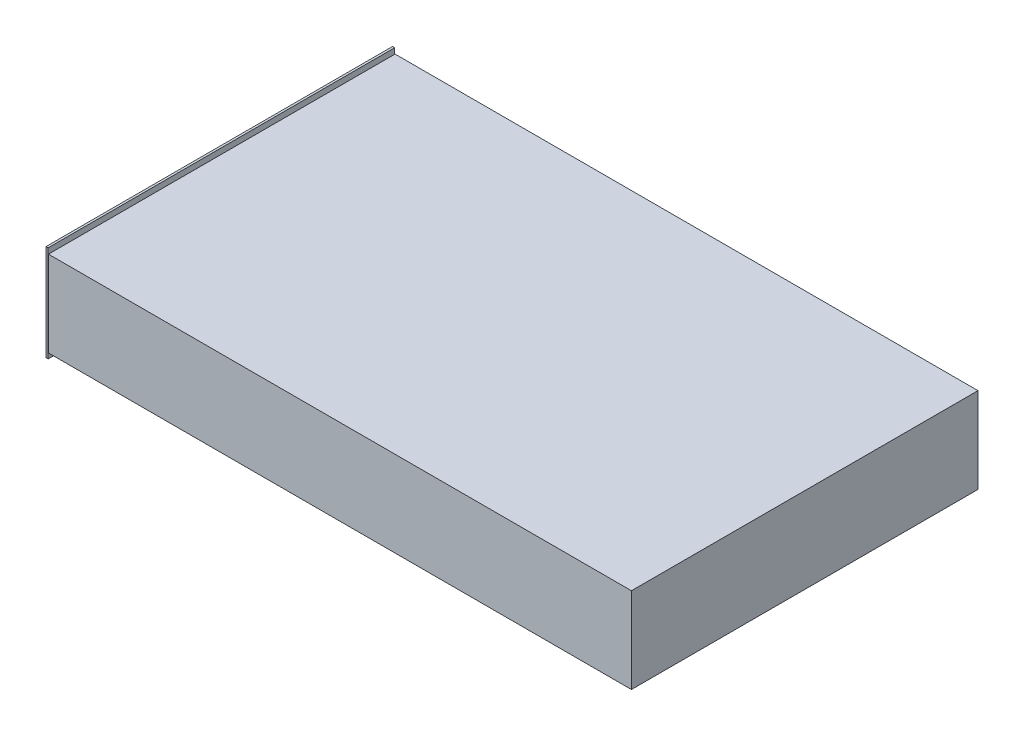
ISO-10303-21;
HEADER;
FILE_DESCRIPTION(('STEP AP214'),'2;1');
FILE_NAME('part.step','',(''),(''),'','','');
FILE_SCHEMA(('AUTOMOTIVE_DESIGN { 1 0 10303 214 1 1 1 1 }'));
ENDSEC;
DATA;
#1=APPLICATION_CONTEXT('core data for automotive mechanical design processes');
#2=APPLICATION_PROTOCOL_DEFINITION('international standard','automotive_design',2000,#1);
#3=PRODUCT_CONTEXT('',#1,'mechanical');
#4=PRODUCT('Part','Part','',(#3));
#5=PRODUCT_RELATED_PRODUCT_CATEGORY('part','',(#4));
#6=PRODUCT_DEFINITION_FORMATION('','',#4);
#7=PRODUCT_DEFINITION_CONTEXT('part definition',#1,'design');
#8=PRODUCT_DEFINITION('design','',#6,#7);
#9=PRODUCT_DEFINITION_SHAPE('','',#8);
#10=(LENGTH_UNIT() NAMED_UNIT(*) SI_UNIT(.MILLI.,.METRE.));
#11=(NAMED_UNIT(*) PLANE_ANGLE_UNIT() SI_UNIT($,.RADIAN.));
#12=(NAMED_UNIT(*) SI_UNIT($,.STERADIAN.) SOLID_ANGLE_UNIT());
#13=UNCERTAINTY_MEASURE_WITH_UNIT(LENGTH_MEASURE(1.E-05),#10,'distance_accuracy_value','');
#14=(GEOMETRIC_REPRESENTATION_CONTEXT(3) GLOBAL_UNCERTAINTY_ASSIGNED_CONTEXT((#13)) GLOBAL_UNIT_ASSIGNED_CONTEXT((#10,
#11,#12)) REPRESENTATION_CONTEXT('',''));
#15=CARTESIAN_POINT('',(0.,0.,0.));
#16=DIRECTION('',(0.,0.,1.));
#17=DIRECTION('',(1.,0.,0.));
#18=AXIS2_PLACEMENT_3D('',#15,#16,#17);
#19=CARTESIAN_POINT('',(0.,-5.,162.));
#20=DIRECTION('',(-1.,0.,0.));
#21=DIRECTION('',(0.,0.,1.));
#22=AXIS2_PLACEMENT_3D('',#19,#20,#21);
#23=PLANE('',#22);
#24=DIRECTION('',(0.,1.,0.));
#25=VECTOR('',#24,1.);
#26=CARTESIAN_POINT('',(0.,-5.,-162.));
#27=LINE('',#26,#25);
#28=CARTESIAN_POINT('',(0.,-5.,-162.));
#29=VERTEX_POINT('',#28);
#30=CARTESIAN_POINT('',(0.,85.,-162.));
#31=VERTEX_POINT('',#30);
#32=EDGE_CURVE('E107',#29,#31,#27,.T.);
#33=ORIENTED_EDGE('',*,*,#32,.T.);
#34=DIRECTION('',(0.,0.,-1.));
#35=VECTOR('',#34,1.);
#36=CARTESIAN_POINT('',(0.,85.,162.));
#37=LINE('',#36,#35);
#38=CARTESIAN_POINT('',(0.,85.,162.));
#39=VERTEX_POINT('',#38);
#40=EDGE_CURVE('E12',#39,#31,#37,.T.);
#41=ORIENTED_EDGE('',*,*,#40,.F.);
#42=DIRECTION('',(0.,1.,0.));
#43=VECTOR('',#42,1.);
#44=CARTESIAN_POINT('',(0.,-5.,162.));
#45=LINE('',#44,#43);
#46=CARTESIAN_POINT('',(0.,-5.,162.));
#47=VERTEX_POINT('',#46);
#48=EDGE_CURVE('E84',#47,#39,#45,.T.);
#49=ORIENTED_EDGE('',*,*,#48,.F.);
#50=DIRECTION('',(0.,0.,-1.));
#51=VECTOR('',#50,1.);
#52=CARTESIAN_POINT('',(0.,-5.,162.));
#53=LINE('',#52,#51);
#54=EDGE_CURVE('E60',#47,#29,#53,.T.);
#55=ORIENTED_EDGE('',*,*,#54,.T.);
#56=EDGE_LOOP('',(#33,#41,#49,#55));
#57=FACE_BOUND('',#56,.T.);
#58=ADVANCED_FACE('F44',(#57),#23,.F.);
#59=CARTESIAN_POINT('',(-2.,85.,162.));
#60=DIRECTION('',(0.,1.,0.));
#61=DIRECTION('',(0.,0.,1.));
#62=AXIS2_PLACEMENT_3D('',#59,#60,#61);
#63=PLANE('',#62);
#64=DIRECTION('',(1.,0.,0.));
#65=VECTOR('',#64,1.);
#66=CARTESIAN_POINT('',(-2.,85.,-162.));
#67=LINE('',#66,#65);
#68=CARTESIAN_POINT('',(-2.,85.,-162.));
#69=VERTEX_POINT('',#68);
#70=EDGE_CURVE('E93',#69,#31,#67,.T.);
#71=ORIENTED_EDGE('',*,*,#70,.F.);
#72=DIRECTION('',(0.,0.,-1.));
#73=VECTOR('',#72,1.);
#74=CARTESIAN_POINT('',(-2.,85.,162.));
#75=LINE('',#74,#73);
#76=CARTESIAN_POINT('',(-2.,85.,162.));
#77=VERTEX_POINT('',#76);
#78=EDGE_CURVE('E52',#77,#69,#75,.T.);
#79=ORIENTED_EDGE('',*,*,#78,.F.);
#80=DIRECTION('',(1.,0.,0.));
#81=VECTOR('',#80,1.);
#82=CARTESIAN_POINT('',(-2.,85.,162.));
#83=LINE('',#82,#81);
#84=EDGE_CURVE('E91',#77,#39,#83,.T.);
#85=ORIENTED_EDGE('',*,*,#84,.T.);
#86=ORIENTED_EDGE('',*,*,#40,.T.);
#87=EDGE_LOOP('',(#71,#79,#85,#86));
#88=FACE_BOUND('',#87,.T.);
#89=ADVANCED_FACE('F90',(#88),#63,.T.);
#90=CARTESIAN_POINT('',(-2.,-5.,162.));
#91=DIRECTION('',(-1.,0.,0.));
#92=DIRECTION('',(0.,0.,1.));
#93=AXIS2_PLACEMENT_3D('',#90,#91,#92);
#94=PLANE('',#93);
#95=DIRECTION('',(0.,1.,0.));
#96=VECTOR('',#95,1.);
#97=CARTESIAN_POINT('',(-2.,-5.,-162.));
#98=LINE('',#97,#96);
#99=CARTESIAN_POINT('',(-2.,-5.,-162.));
#100=VERTEX_POINT('',#99);
#101=EDGE_CURVE('E110',#100,#69,#98,.T.);
#102=ORIENTED_EDGE('',*,*,#101,.F.);
#103=DIRECTION('',(0.,0.,-1.));
#104=VECTOR('',#103,1.);
#105=CARTESIAN_POINT('',(-2.,-5.,162.));
#106=LINE('',#105,#104);
#107=CARTESIAN_POINT('',(-2.,-5.,162.));
#108=VERTEX_POINT('',#107);
#109=EDGE_CURVE('E73',#108,#100,#106,.T.);
#110=ORIENTED_EDGE('',*,*,#109,.F.);
#111=DIRECTION('',(0.,1.,0.));
#112=VECTOR('',#111,1.);
#113=CARTESIAN_POINT('',(-2.,-5.,162.));
#114=LINE('',#113,#112);
#115=EDGE_CURVE('E99',#108,#77,#114,.T.);
#116=ORIENTED_EDGE('',*,*,#115,.T.);
#117=ORIENTED_EDGE('',*,*,#78,.T.);
#118=EDGE_LOOP('',(#102,#110,#116,#117));
#119=FACE_BOUND('',#118,.T.);
#120=ADVANCED_FACE('F101',(#119),#94,.T.);
#121=CARTESIAN_POINT('',(0.,-5.,162.));
#122=DIRECTION('',(0.,-1.,0.));
#123=DIRECTION('',(0.,0.,-1.));
#124=AXIS2_PLACEMENT_3D('',#121,#122,#123);
#125=PLANE('',#124);
#126=DIRECTION('',(-1.,0.,0.));
#127=VECTOR('',#126,1.);
#128=CARTESIAN_POINT('',(0.,-5.,-162.));
#129=LINE('',#128,#127);
#130=EDGE_CURVE('E112',#29,#100,#129,.T.);
#131=ORIENTED_EDGE('',*,*,#130,.F.);
#132=ORIENTED_EDGE('',*,*,#54,.F.);
#133=DIRECTION('',(-1.,0.,0.));
#134=VECTOR('',#133,1.);
#135=CARTESIAN_POINT('',(0.,-5.,162.));
#136=LINE('',#135,#134);
#137=EDGE_CURVE('E102',#47,#108,#136,.T.);
#138=ORIENTED_EDGE('',*,*,#137,.T.);
#139=ORIENTED_EDGE('',*,*,#109,.T.);
#140=EDGE_LOOP('',(#131,#132,#138,#139));
#141=FACE_BOUND('',#140,.T.);
#142=ADVANCED_FACE('F118',(#141),#125,.T.);
#143=CARTESIAN_POINT('',(0.,0.,162.));
#144=DIRECTION('',(0.,0.,-1.));
#145=DIRECTION('',(-1.,0.,0.));
#146=AXIS2_PLACEMENT_3D('',#143,#144,#145);
#147=PLANE('',#146);
#148=ORIENTED_EDGE('',*,*,#48,.T.);
#149=ORIENTED_EDGE('',*,*,#84,.F.);
#150=ORIENTED_EDGE('',*,*,#115,.F.);
#151=ORIENTED_EDGE('',*,*,#137,.F.);
#152=EDGE_LOOP('',(#148,#149,#150,#151));
#153=FACE_BOUND('',#152,.T.);
#154=ADVANCED_FACE('F98',(#153),#147,.F.);
#155=CARTESIAN_POINT('',(0.,0.,-162.));
#156=DIRECTION('',(0.,0.,-1.));
#157=DIRECTION('',(-1.,0.,0.));
#158=AXIS2_PLACEMENT_3D('',#155,#156,#157);
#159=PLANE('',#158);
#160=ORIENTED_EDGE('',*,*,#32,.F.);
#161=ORIENTED_EDGE('',*,*,#130,.T.);
#162=ORIENTED_EDGE('',*,*,#101,.T.);
#163=ORIENTED_EDGE('',*,*,#70,.T.);
#164=EDGE_LOOP('',(#160,#161,#162,#163));
#165=FACE_BOUND('',#164,.T.);
#166=ADVANCED_FACE('F117',(#165),#159,.T.);
#167=CLOSED_SHELL('',(#58,#89,#120,#142,#154,#166));
#168=MANIFOLD_SOLID_BREP('B2',#167);
#169=CARTESIAN_POINT('',(0.310787999523887,80.,162.));
#170=DIRECTION('',(1.,0.,0.));
#171=DIRECTION('',(0.,0.,-1.));
#172=AXIS2_PLACEMENT_3D('',#169,#170,#171);
#173=PLANE('',#172);
#174=DIRECTION('',(0.,0.,1.));
#175=VECTOR('',#174,1.);
#176=CARTESIAN_POINT('',(0.310787999523887,0.,162.));
#177=LINE('',#176,#175);
#178=CARTESIAN_POINT('',(0.310787999523887,0.,-162.));
#179=VERTEX_POINT('',#178);
#180=CARTESIAN_POINT('',(0.310787999523887,0.,162.));
#181=VERTEX_POINT('',#180);
#182=EDGE_CURVE('E266',#179,#181,#177,.T.);
#183=ORIENTED_EDGE('',*,*,#182,.T.);
#184=DIRECTION('',(0.,-1.,0.));
#185=VECTOR('',#184,1.);
#186=CARTESIAN_POINT('',(0.310787999523887,80.,162.));
#187=LINE('',#186,#185);
#188=CARTESIAN_POINT('',(0.310787999523887,80.,162.));
#189=VERTEX_POINT('',#188);
#190=EDGE_CURVE('E42',#189,#181,#187,.T.);
#191=ORIENTED_EDGE('',*,*,#190,.F.);
#192=DIRECTION('',(0.,0.,1.));
#193=VECTOR('',#192,1.);
#194=CARTESIAN_POINT('',(0.310787999523887,80.,162.));
#195=LINE('',#194,#193);
#196=CARTESIAN_POINT('',(0.310787999523887,80.,-162.));
#197=VERTEX_POINT('',#196);
#198=EDGE_CURVE('E276',#197,#189,#195,.T.);
#199=ORIENTED_EDGE('',*,*,#198,.F.);
#200=DIRECTION('',(0.,-1.,0.));
#201=VECTOR('',#200,1.);
#202=CARTESIAN_POINT('',(0.310787999523887,80.,-162.));
#203=LINE('',#202,#201);
#204=EDGE_CURVE('E281',#197,#179,#203,.T.);
#205=ORIENTED_EDGE('',*,*,#204,.T.);
#206=EDGE_LOOP('',(#183,#191,#199,#205));
#207=FACE_BOUND('',#206,.T.);
#208=ADVANCED_FACE('F168',(#207),#173,.F.);
#209=CARTESIAN_POINT('',(0.310787999523887,80.,162.));
#210=DIRECTION('',(0.,0.,-1.));
#211=DIRECTION('',(-1.,0.,0.));
#212=AXIS2_PLACEMENT_3D('',#209,#210,#211);
#213=PLANE('',#212);
#214=DIRECTION('',(1.,0.,0.));
#215=VECTOR('',#214,1.);
#216=CARTESIAN_POINT('',(0.310787999523887,0.,162.));
#217=LINE('',#216,#215);
#218=CARTESIAN_POINT('',(545.310787999524,0.,162.));
#219=VERTEX_POINT('',#218);
#220=EDGE_CURVE('E270',#181,#219,#217,.T.);
#221=ORIENTED_EDGE('',*,*,#220,.T.);
#222=DIRECTION('',(0.,-1.,0.));
#223=VECTOR('',#222,1.);
#224=CARTESIAN_POINT('',(545.310787999524,80.,162.));
#225=LINE('',#224,#223);
#226=CARTESIAN_POINT('',(545.310787999524,80.,162.));
#227=VERTEX_POINT('',#226);
#228=EDGE_CURVE('E176',#227,#219,#225,.T.);
#229=ORIENTED_EDGE('',*,*,#228,.F.);
#230=DIRECTION('',(1.,0.,0.));
#231=VECTOR('',#230,1.);
#232=CARTESIAN_POINT('',(0.310787999523887,80.,162.));
#233=LINE('',#232,#231);
#234=EDGE_CURVE('E215',#189,#227,#233,.T.);
#235=ORIENTED_EDGE('',*,*,#234,.F.);
#236=ORIENTED_EDGE('',*,*,#190,.T.);
#237=EDGE_LOOP('',(#221,#229,#235,#236));
#238=FACE_BOUND('',#237,.T.);
#239=ADVANCED_FACE('F305',(#238),#213,.F.);
#240=CARTESIAN_POINT('',(545.310787999524,80.,162.));
#241=DIRECTION('',(-1.,0.,0.));
#242=DIRECTION('',(0.,0.,1.));
#243=AXIS2_PLACEMENT_3D('',#240,#241,#242);
#244=PLANE('',#243);
#245=DIRECTION('',(0.,0.,-1.));
#246=VECTOR('',#245,1.);
#247=CARTESIAN_POINT('',(545.310787999524,0.,162.));
#248=LINE('',#247,#246);
#249=CARTESIAN_POINT('',(545.310787999524,0.,-162.));
#250=VERTEX_POINT('',#249);
#251=EDGE_CURVE('E202',#219,#250,#248,.T.);
#252=ORIENTED_EDGE('',*,*,#251,.T.);
#253=DIRECTION('',(0.,-1.,0.));
#254=VECTOR('',#253,1.);
#255=CARTESIAN_POINT('',(545.310787999524,80.,-162.));
#256=LINE('',#255,#254);
#257=CARTESIAN_POINT('',(545.310787999524,80.,-162.));
#258=VERTEX_POINT('',#257);
#259=EDGE_CURVE('E287',#258,#250,#256,.T.);
#260=ORIENTED_EDGE('',*,*,#259,.F.);
#261=DIRECTION('',(0.,0.,-1.));
#262=VECTOR('',#261,1.);
#263=CARTESIAN_POINT('',(545.310787999524,80.,162.));
#264=LINE('',#263,#262);
#265=EDGE_CURVE('E279',#227,#258,#264,.T.);
#266=ORIENTED_EDGE('',*,*,#265,.F.);
#267=ORIENTED_EDGE('',*,*,#228,.T.);
#268=EDGE_LOOP('',(#252,#260,#266,#267));
#269=FACE_BOUND('',#268,.T.);
#270=ADVANCED_FACE('F289',(#269),#244,.F.);
#271=CARTESIAN_POINT('',(0.310787999523887,80.,-162.));
#272=DIRECTION('',(0.,0.,1.));
#273=DIRECTION('',(1.,0.,0.));
#274=AXIS2_PLACEMENT_3D('',#271,#272,#273);
#275=PLANE('',#274);
#276=DIRECTION('',(-1.,0.,0.));
#277=VECTOR('',#276,1.);
#278=CARTESIAN_POINT('',(0.310787999523887,0.,-162.));
#279=LINE('',#278,#277);
#280=EDGE_CURVE('E208',#250,#179,#279,.T.);
#281=ORIENTED_EDGE('',*,*,#280,.T.);
#282=ORIENTED_EDGE('',*,*,#204,.F.);
#283=DIRECTION('',(-1.,0.,0.));
#284=VECTOR('',#283,1.);
#285=CARTESIAN_POINT('',(0.310787999523887,80.,-162.));
#286=LINE('',#285,#284);
#287=EDGE_CURVE('E184',#258,#197,#286,.T.);
#288=ORIENTED_EDGE('',*,*,#287,.F.);
#289=ORIENTED_EDGE('',*,*,#259,.T.);
#290=EDGE_LOOP('',(#281,#282,#288,#289));
#291=FACE_BOUND('',#290,.T.);
#292=ADVANCED_FACE('F296',(#291),#275,.F.);
#293=CARTESIAN_POINT('',(0.,80.,0.));
#294=DIRECTION('',(0.,1.,0.));
#295=DIRECTION('',(0.,0.,1.));
#296=AXIS2_PLACEMENT_3D('',#293,#294,#295);
#297=PLANE('',#296);
#298=ORIENTED_EDGE('',*,*,#198,.T.);
#299=ORIENTED_EDGE('',*,*,#234,.T.);
#300=ORIENTED_EDGE('',*,*,#265,.T.);
#301=ORIENTED_EDGE('',*,*,#287,.T.);
#302=EDGE_LOOP('',(#298,#299,#300,#301));
#303=FACE_BOUND('',#302,.T.);
#304=ADVANCED_FACE('F298',(#303),#297,.T.);
#305=CARTESIAN_POINT('',(0.,0.,0.));
#306=DIRECTION('',(0.,1.,0.));
#307=DIRECTION('',(0.,0.,1.));
#308=AXIS2_PLACEMENT_3D('',#305,#306,#307);
#309=PLANE('',#308);
#310=ORIENTED_EDGE('',*,*,#182,.F.);
#311=ORIENTED_EDGE('',*,*,#280,.F.);
#312=ORIENTED_EDGE('',*,*,#251,.F.);
#313=ORIENTED_EDGE('',*,*,#220,.F.);
#314=EDGE_LOOP('',(#310,#311,#312,#313));
#315=FACE_BOUND('',#314,.T.);
#316=ADVANCED_FACE('F292',(#315),#309,.F.);
#317=CLOSED_SHELL('',(#208,#239,#270,#292,#304,#316));
#318=CARTESIAN_POINT('',(1.81078799952389,78.5,0.));
#319=DIRECTION('',(1.,0.,0.));
#320=DIRECTION('',(0.,0.,-1.));
#321=AXIS2_PLACEMENT_3D('',#318,#319,#320);
#322=PLANE('',#321);
#323=DIRECTION('',(0.,0.,1.));
#324=VECTOR('',#323,1.);
#325=CARTESIAN_POINT('',(1.81078799952389,1.5,0.));
#326=LINE('',#325,#324);
#327=CARTESIAN_POINT('',(1.81078799952389,1.5,-160.5));
#328=VERTEX_POINT('',#327);
#329=CARTESIAN_POINT('',(1.81078799952389,1.5,160.5));
#330=VERTEX_POINT('',#329);
#331=EDGE_CURVE('E395',#328,#330,#326,.T.);
#332=ORIENTED_EDGE('',*,*,#331,.F.);
#333=DIRECTION('',(0.,-1.,0.));
#334=VECTOR('',#333,1.);
#335=CARTESIAN_POINT('',(1.81078799952389,78.5,-160.5));
#336=LINE('',#335,#334);
#337=CARTESIAN_POINT('',(1.81078799952389,78.5,-160.5));
#338=VERTEX_POINT('',#337);
#339=EDGE_CURVE('E261',#338,#328,#336,.T.);
#340=ORIENTED_EDGE('',*,*,#339,.F.);
#341=DIRECTION('',(0.,0.,1.));
#342=VECTOR('',#341,1.);
#343=CARTESIAN_POINT('',(1.81078799952389,78.5,0.));
#344=LINE('',#343,#342);
#345=CARTESIAN_POINT('',(1.81078799952389,78.5,160.5));
#346=VERTEX_POINT('',#345);
#347=EDGE_CURVE('E246',#338,#346,#344,.T.);
#348=ORIENTED_EDGE('',*,*,#347,.T.);
#349=DIRECTION('',(0.,-1.,0.));
#350=VECTOR('',#349,1.);
#351=CARTESIAN_POINT('',(1.81078799952389,78.5,160.5));
#352=LINE('',#351,#350);
#353=EDGE_CURVE('E258',#346,#330,#352,.T.);
#354=ORIENTED_EDGE('',*,*,#353,.T.);
#355=EDGE_LOOP('',(#332,#340,#348,#354));
#356=FACE_BOUND('',#355,.T.);
#357=ADVANCED_FACE('F257',(#356),#322,.T.);
#358=CARTESIAN_POINT('',(0.,78.5,160.5));
#359=DIRECTION('',(0.,0.,-1.));
#360=DIRECTION('',(-1.,0.,0.));
#361=AXIS2_PLACEMENT_3D('',#358,#359,#360);
#362=PLANE('',#361);
#363=DIRECTION('',(1.,0.,0.));
#364=VECTOR('',#363,1.);
#365=CARTESIAN_POINT('',(0.,1.5,160.5));
#366=LINE('',#365,#364);
#367=CARTESIAN_POINT('',(543.810787999524,1.5,160.5));
#368=VERTEX_POINT('',#367);
#369=EDGE_CURVE('E265',#330,#368,#366,.T.);
#370=ORIENTED_EDGE('',*,*,#369,.F.);
#371=ORIENTED_EDGE('',*,*,#353,.F.);
#372=DIRECTION('',(1.,0.,0.));
#373=VECTOR('',#372,1.);
#374=CARTESIAN_POINT('',(0.,78.5,160.5));
#375=LINE('',#374,#373);
#376=CARTESIAN_POINT('',(543.810787999524,78.5,160.5));
#377=VERTEX_POINT('',#376);
#378=EDGE_CURVE('E242',#346,#377,#375,.T.);
#379=ORIENTED_EDGE('',*,*,#378,.T.);
#380=DIRECTION('',(0.,-1.,0.));
#381=VECTOR('',#380,1.);
#382=CARTESIAN_POINT('',(543.810787999524,78.5,160.5));
#383=LINE('',#382,#381);
#384=EDGE_CURVE('E267',#377,#368,#383,.T.);
#385=ORIENTED_EDGE('',*,*,#384,.T.);
#386=EDGE_LOOP('',(#370,#371,#379,#385));
#387=FACE_BOUND('',#386,.T.);
#388=ADVANCED_FACE('F264',(#387),#362,.T.);
#389=CARTESIAN_POINT('',(543.810787999524,78.5,0.));
#390=DIRECTION('',(-1.,0.,0.));
#391=DIRECTION('',(0.,0.,1.));
#392=AXIS2_PLACEMENT_3D('',#389,#390,#391);
#393=PLANE('',#392);
#394=DIRECTION('',(0.,0.,-1.));
#395=VECTOR('',#394,1.);
#396=CARTESIAN_POINT('',(543.810787999524,1.5,0.));
#397=LINE('',#396,#395);
#398=CARTESIAN_POINT('',(543.810787999524,1.5,-160.5));
#399=VERTEX_POINT('',#398);
#400=EDGE_CURVE('E398',#368,#399,#397,.T.);
#401=ORIENTED_EDGE('',*,*,#400,.F.);
#402=ORIENTED_EDGE('',*,*,#384,.F.);
#403=DIRECTION('',(0.,0.,-1.));
#404=VECTOR('',#403,1.);
#405=CARTESIAN_POINT('',(543.810787999524,78.5,0.));
#406=LINE('',#405,#404);
#407=CARTESIAN_POINT('',(543.810787999524,78.5,-160.5));
#408=VERTEX_POINT('',#407);
#409=EDGE_CURVE('E247',#377,#408,#406,.T.);
#410=ORIENTED_EDGE('',*,*,#409,.T.);
#411=DIRECTION('',(0.,-1.,0.));
#412=VECTOR('',#411,1.);
#413=CARTESIAN_POINT('',(543.810787999524,78.5,-160.5));
#414=LINE('',#413,#412);
#415=EDGE_CURVE('E272',#408,#399,#414,.T.);
#416=ORIENTED_EDGE('',*,*,#415,.T.);
#417=EDGE_LOOP('',(#401,#402,#410,#416));
#418=FACE_BOUND('',#417,.T.);
#419=ADVANCED_FACE('F353',(#418),#393,.T.);
#420=CARTESIAN_POINT('',(0.,78.5,-160.5));
#421=DIRECTION('',(0.,0.,1.));
#422=DIRECTION('',(1.,0.,0.));
#423=AXIS2_PLACEMENT_3D('',#420,#421,#422);
#424=PLANE('',#423);
#425=DIRECTION('',(-1.,0.,0.));
#426=VECTOR('',#425,1.);
#427=CARTESIAN_POINT('',(0.,1.5,-160.5));
#428=LINE('',#427,#426);
#429=EDGE_CURVE('E262',#399,#328,#428,.T.);
#430=ORIENTED_EDGE('',*,*,#429,.F.);
#431=ORIENTED_EDGE('',*,*,#415,.F.);
#432=DIRECTION('',(-1.,0.,0.));
#433=VECTOR('',#432,1.);
#434=CARTESIAN_POINT('',(0.,78.5,-160.5));
#435=LINE('',#434,#433);
#436=EDGE_CURVE('E401',#408,#338,#435,.T.);
#437=ORIENTED_EDGE('',*,*,#436,.T.);
#438=ORIENTED_EDGE('',*,*,#339,.T.);
#439=EDGE_LOOP('',(#430,#431,#437,#438));
#440=FACE_BOUND('',#439,.T.);
#441=ADVANCED_FACE('F362',(#440),#424,.T.);
#442=CARTESIAN_POINT('',(0.,78.5,0.));
#443=DIRECTION('',(0.,1.,0.));
#444=DIRECTION('',(0.,0.,1.));
#445=AXIS2_PLACEMENT_3D('',#442,#443,#444);
#446=PLANE('',#445);
#447=ORIENTED_EDGE('',*,*,#347,.F.);
#448=ORIENTED_EDGE('',*,*,#436,.F.);
#449=ORIENTED_EDGE('',*,*,#409,.F.);
#450=ORIENTED_EDGE('',*,*,#378,.F.);
#451=EDGE_LOOP('',(#447,#448,#449,#450));
#452=FACE_BOUND('',#451,.T.);
#453=ADVANCED_FACE('F244',(#452),#446,.F.);
#454=CARTESIAN_POINT('',(0.,1.5,0.));
#455=DIRECTION('',(0.,1.,0.));
#456=DIRECTION('',(0.,0.,1.));
#457=AXIS2_PLACEMENT_3D('',#454,#455,#456);
#458=PLANE('',#457);
#459=ORIENTED_EDGE('',*,*,#331,.T.);
#460=ORIENTED_EDGE('',*,*,#369,.T.);
#461=ORIENTED_EDGE('',*,*,#400,.T.);
#462=ORIENTED_EDGE('',*,*,#429,.T.);
#463=EDGE_LOOP('',(#459,#460,#461,#462));
#464=FACE_BOUND('',#463,.T.);
#465=ADVANCED_FACE('F381',(#464),#458,.T.);
#466=CLOSED_SHELL('',(#357,#388,#419,#441,#453,#465));
#467=ORIENTED_CLOSED_SHELL('',*,#466,.T.);
#468=BREP_WITH_VOIDS('B6',#317,(#467));
#469=ADVANCED_BREP_SHAPE_REPRESENTATION('',(#18,#168,#468),#14);
#470=SHAPE_DEFINITION_REPRESENTATION(#9,#469);
ENDSEC;
END-ISO-10303-21;
